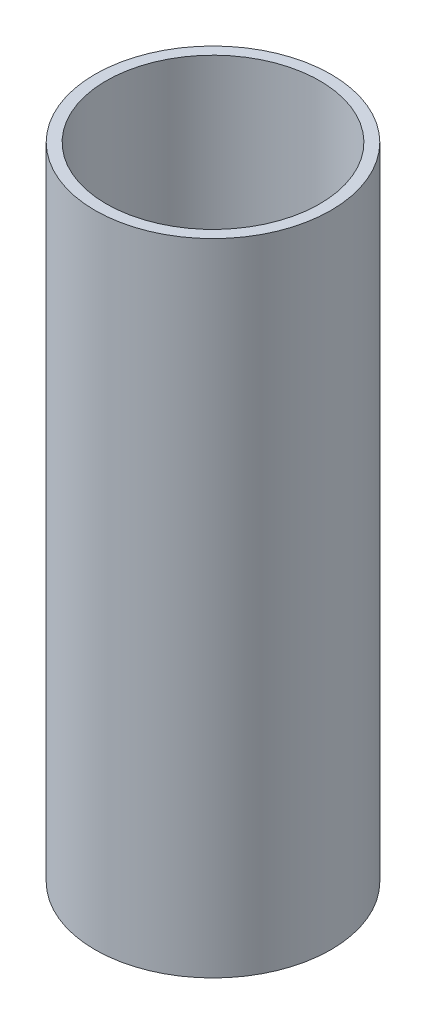
ISO-10303-21;
HEADER;
FILE_DESCRIPTION(('STEP AP214'),'2;1');
FILE_NAME('part.step','',(''),(''),'','','');
FILE_SCHEMA(('AUTOMOTIVE_DESIGN { 1 0 10303 214 1 1 1 1 }'));
ENDSEC;
DATA;
#1=APPLICATION_CONTEXT('core data for automotive mechanical design processes');
#2=APPLICATION_PROTOCOL_DEFINITION('international standard','automotive_design',2000,#1);
#3=PRODUCT_CONTEXT('',#1,'mechanical');
#4=PRODUCT('Part','Part','',(#3));
#5=PRODUCT_RELATED_PRODUCT_CATEGORY('part','',(#4));
#6=PRODUCT_DEFINITION_FORMATION('','',#4);
#7=PRODUCT_DEFINITION_CONTEXT('part definition',#1,'design');
#8=PRODUCT_DEFINITION('design','',#6,#7);
#9=PRODUCT_DEFINITION_SHAPE('','',#8);
#10=(LENGTH_UNIT() NAMED_UNIT(*) SI_UNIT(.MILLI.,.METRE.));
#11=(NAMED_UNIT(*) PLANE_ANGLE_UNIT() SI_UNIT($,.RADIAN.));
#12=(NAMED_UNIT(*) SI_UNIT($,.STERADIAN.) SOLID_ANGLE_UNIT());
#13=UNCERTAINTY_MEASURE_WITH_UNIT(LENGTH_MEASURE(1.E-05),#10,'distance_accuracy_value','');
#14=(GEOMETRIC_REPRESENTATION_CONTEXT(3) GLOBAL_UNCERTAINTY_ASSIGNED_CONTEXT((#13)) GLOBAL_UNIT_ASSIGNED_CONTEXT((#10,
#11,#12)) REPRESENTATION_CONTEXT('',''));
#15=CARTESIAN_POINT('',(0.,0.,0.));
#16=DIRECTION('',(0.,0.,1.));
#17=DIRECTION('',(1.,0.,0.));
#18=AXIS2_PLACEMENT_3D('',#15,#16,#17);
#19=CARTESIAN_POINT('',(0.,0.,0.));
#20=DIRECTION('',(0.,1.,0.));
#21=DIRECTION('',(0.,0.,1.));
#22=AXIS2_PLACEMENT_3D('',#19,#20,#21);
#23=PLANE('',#22);
#24=CARTESIAN_POINT('',(0.,0.,0.));
#25=DIRECTION('',(0.,1.,0.));
#26=DIRECTION('',(0.,0.,1.));
#27=AXIS2_PLACEMENT_3D('',#24,#25,#26);
#28=CIRCLE('',#27,21.);
#29=CARTESIAN_POINT('',(0.,0.,21.));
#30=VERTEX_POINT('',#29);
#31=EDGE_CURVE('E10',#30,#30,#28,.T.);
#32=ORIENTED_EDGE('',*,*,#31,.F.);
#33=EDGE_LOOP('',(#32));
#34=FACE_BOUND('',#33,.T.);
#35=CARTESIAN_POINT('',(0.,0.,0.));
#36=DIRECTION('',(0.,1.,0.));
#37=DIRECTION('',(0.,0.,1.));
#38=AXIS2_PLACEMENT_3D('',#35,#36,#37);
#39=CIRCLE('',#38,19.);
#40=CARTESIAN_POINT('',(0.,0.,19.));
#41=VERTEX_POINT('',#40);
#42=EDGE_CURVE('E45',#41,#41,#39,.T.);
#43=ORIENTED_EDGE('',*,*,#42,.T.);
#44=EDGE_LOOP('',(#43));
#45=FACE_BOUND('',#44,.T.);
#46=ADVANCED_FACE('F37',(#34,#45),#23,.F.);
#47=CARTESIAN_POINT('',(0.,49.,0.));
#48=DIRECTION('',(0.,-1.,0.));
#49=DIRECTION('',(0.,0.,-1.));
#50=AXIS2_PLACEMENT_3D('',#47,#48,#49);
#51=CYLINDRICAL_SURFACE('',#50,21.);
#52=ORIENTED_EDGE('',*,*,#31,.T.);
#53=EDGE_LOOP('',(#52));
#54=FACE_BOUND('',#53,.T.);
#55=CARTESIAN_POINT('',(0.,114.,0.));
#56=DIRECTION('',(0.,1.,0.));
#57=DIRECTION('',(0.,0.,1.));
#58=AXIS2_PLACEMENT_3D('',#55,#56,#57);
#59=CIRCLE('',#58,21.);
#60=CARTESIAN_POINT('',(0.,114.,21.));
#61=VERTEX_POINT('',#60);
#62=EDGE_CURVE('E50',#61,#61,#59,.T.);
#63=ORIENTED_EDGE('',*,*,#62,.F.);
#64=EDGE_LOOP('',(#63));
#65=FACE_BOUND('',#64,.T.);
#66=ADVANCED_FACE('F39',(#54,#65),#51,.T.);
#67=CARTESIAN_POINT('',(0.,49.,0.));
#68=DIRECTION('',(0.,-1.,0.));
#69=DIRECTION('',(0.,0.,-1.));
#70=AXIS2_PLACEMENT_3D('',#67,#68,#69);
#71=CYLINDRICAL_SURFACE('',#70,19.);
#72=ORIENTED_EDGE('',*,*,#42,.F.);
#73=EDGE_LOOP('',(#72));
#74=FACE_BOUND('',#73,.T.);
#75=CARTESIAN_POINT('',(0.,114.,0.));
#76=DIRECTION('',(0.,1.,0.));
#77=DIRECTION('',(0.,0.,1.));
#78=AXIS2_PLACEMENT_3D('',#75,#76,#77);
#79=CIRCLE('',#78,19.);
#80=CARTESIAN_POINT('',(0.,114.,19.));
#81=VERTEX_POINT('',#80);
#82=EDGE_CURVE('E55',#81,#81,#79,.T.);
#83=ORIENTED_EDGE('',*,*,#82,.T.);
#84=EDGE_LOOP('',(#83));
#85=FACE_BOUND('',#84,.T.);
#86=ADVANCED_FACE('F62',(#74,#85),#71,.F.);
#87=CARTESIAN_POINT('',(0.,114.,0.));
#88=DIRECTION('',(0.,1.,0.));
#89=DIRECTION('',(0.,0.,1.));
#90=AXIS2_PLACEMENT_3D('',#87,#88,#89);
#91=PLANE('',#90);
#92=ORIENTED_EDGE('',*,*,#62,.T.);
#93=EDGE_LOOP('',(#92));
#94=FACE_BOUND('',#93,.T.);
#95=ORIENTED_EDGE('',*,*,#82,.F.);
#96=EDGE_LOOP('',(#95));
#97=FACE_BOUND('',#96,.T.);
#98=ADVANCED_FACE('F64',(#94,#97),#91,.T.);
#99=CLOSED_SHELL('',(#46,#66,#86,#98));
#100=MANIFOLD_SOLID_BREP('B2',#99);
#101=ADVANCED_BREP_SHAPE_REPRESENTATION('',(#18,#100),#14);
#102=SHAPE_DEFINITION_REPRESENTATION(#9,#101);
ENDSEC;
END-ISO-10303-21;
